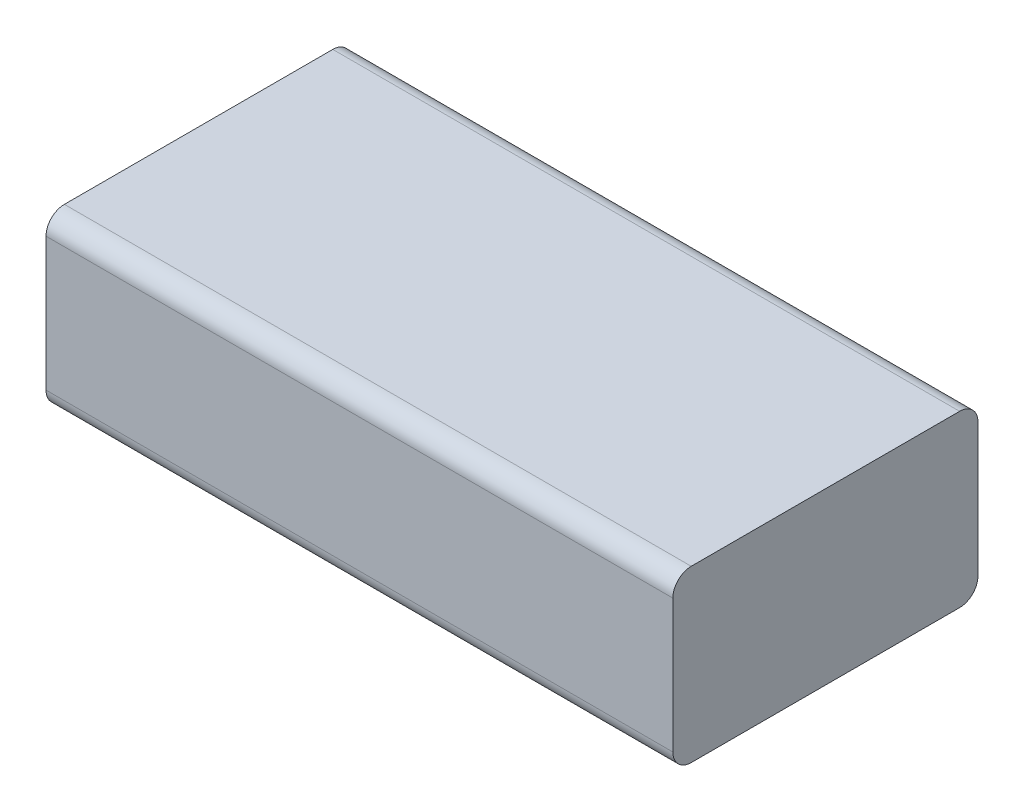
ISO-10303-21;
HEADER;
FILE_DESCRIPTION(('STEP AP214'),'2;1');
FILE_NAME('part.step','',(''),(''),'','','');
FILE_SCHEMA(('AUTOMOTIVE_DESIGN { 1 0 10303 214 1 1 1 1 }'));
ENDSEC;
DATA;
#1=APPLICATION_CONTEXT('core data for automotive mechanical design processes');
#2=APPLICATION_PROTOCOL_DEFINITION('international standard','automotive_design',2000,#1);
#3=PRODUCT_CONTEXT('',#1,'mechanical');
#4=PRODUCT('Part','Part','',(#3));
#5=PRODUCT_RELATED_PRODUCT_CATEGORY('part','',(#4));
#6=PRODUCT_DEFINITION_FORMATION('','',#4);
#7=PRODUCT_DEFINITION_CONTEXT('part definition',#1,'design');
#8=PRODUCT_DEFINITION('design','',#6,#7);
#9=PRODUCT_DEFINITION_SHAPE('','',#8);
#10=(LENGTH_UNIT() NAMED_UNIT(*) SI_UNIT(.MILLI.,.METRE.));
#11=(NAMED_UNIT(*) PLANE_ANGLE_UNIT() SI_UNIT($,.RADIAN.));
#12=(NAMED_UNIT(*) SI_UNIT($,.STERADIAN.) SOLID_ANGLE_UNIT());
#13=UNCERTAINTY_MEASURE_WITH_UNIT(LENGTH_MEASURE(1.E-05),#10,'distance_accuracy_value','');
#14=(GEOMETRIC_REPRESENTATION_CONTEXT(3) GLOBAL_UNCERTAINTY_ASSIGNED_CONTEXT((#13)) GLOBAL_UNIT_ASSIGNED_CONTEXT((#10,
#11,#12)) REPRESENTATION_CONTEXT('',''));
#15=CARTESIAN_POINT('',(0.,0.,0.));
#16=DIRECTION('',(0.,0.,1.));
#17=DIRECTION('',(1.,0.,0.));
#18=AXIS2_PLACEMENT_3D('',#15,#16,#17);
#19=CARTESIAN_POINT('',(34.1,18.5,16.6));
#20=DIRECTION('',(-1.,0.,0.));
#21=DIRECTION('',(0.,0.,1.));
#22=AXIS2_PLACEMENT_3D('',#19,#20,#21);
#23=PLANE('',#22);
#24=DIRECTION('',(0.,-1.,0.));
#25=VECTOR('',#24,1.);
#26=CARTESIAN_POINT('',(34.1,18.5,-16.6));
#27=LINE('',#26,#25);
#28=CARTESIAN_POINT('',(34.1,16.5,-16.6));
#29=VERTEX_POINT('',#28);
#30=CARTESIAN_POINT('',(34.1,2.,-16.6));
#31=VERTEX_POINT('',#30);
#32=EDGE_CURVE('E121',#29,#31,#27,.T.);
#33=ORIENTED_EDGE('',*,*,#32,.F.);
#34=CARTESIAN_POINT('',(34.1,16.5,-14.6));
#35=DIRECTION('',(-1.,0.,0.));
#36=DIRECTION('',(0.,0.,1.));
#37=AXIS2_PLACEMENT_3D('',#34,#35,#36);
#38=CIRCLE('',#37,2.);
#39=CARTESIAN_POINT('',(34.1,18.5,-14.6));
#40=VERTEX_POINT('',#39);
#41=EDGE_CURVE('E125',#29,#40,#38,.F.);
#42=ORIENTED_EDGE('',*,*,#41,.T.);
#43=DIRECTION('',(0.,0.,-1.));
#44=VECTOR('',#43,1.);
#45=CARTESIAN_POINT('',(34.1,18.5,16.6));
#46=LINE('',#45,#44);
#47=CARTESIAN_POINT('',(34.1,18.5,14.6));
#48=VERTEX_POINT('',#47);
#49=EDGE_CURVE('E116',#48,#40,#46,.T.);
#50=ORIENTED_EDGE('',*,*,#49,.F.);
#51=CARTESIAN_POINT('',(34.1,16.5,14.6));
#52=DIRECTION('',(-1.,0.,0.));
#53=DIRECTION('',(0.,0.,1.));
#54=AXIS2_PLACEMENT_3D('',#51,#52,#53);
#55=CIRCLE('',#54,2.);
#56=CARTESIAN_POINT('',(34.1,16.5,16.6));
#57=VERTEX_POINT('',#56);
#58=EDGE_CURVE('E62',#48,#57,#55,.F.);
#59=ORIENTED_EDGE('',*,*,#58,.T.);
#60=DIRECTION('',(0.,-1.,0.));
#61=VECTOR('',#60,1.);
#62=CARTESIAN_POINT('',(34.1,18.5,16.6));
#63=LINE('',#62,#61);
#64=CARTESIAN_POINT('',(34.1,2.,16.6));
#65=VERTEX_POINT('',#64);
#66=EDGE_CURVE('E128',#57,#65,#63,.T.);
#67=ORIENTED_EDGE('',*,*,#66,.T.);
#68=CARTESIAN_POINT('',(34.1,2.,14.6));
#69=DIRECTION('',(-1.,0.,0.));
#70=DIRECTION('',(0.,0.,1.));
#71=AXIS2_PLACEMENT_3D('',#68,#69,#70);
#72=CIRCLE('',#71,2.);
#73=CARTESIAN_POINT('',(34.1,0.,14.6));
#74=VERTEX_POINT('',#73);
#75=EDGE_CURVE('E55',#65,#74,#72,.F.);
#76=ORIENTED_EDGE('',*,*,#75,.T.);
#77=DIRECTION('',(0.,0.,-1.));
#78=VECTOR('',#77,1.);
#79=CARTESIAN_POINT('',(34.1,0.,16.6));
#80=LINE('',#79,#78);
#81=CARTESIAN_POINT('',(34.1,0.,-14.6));
#82=VERTEX_POINT('',#81);
#83=EDGE_CURVE('E131',#74,#82,#80,.T.);
#84=ORIENTED_EDGE('',*,*,#83,.T.);
#85=CARTESIAN_POINT('',(34.1,2.,-14.6));
#86=DIRECTION('',(-1.,0.,0.));
#87=DIRECTION('',(0.,0.,1.));
#88=AXIS2_PLACEMENT_3D('',#85,#86,#87);
#89=CIRCLE('',#88,2.);
#90=EDGE_CURVE('E159',#82,#31,#89,.F.);
#91=ORIENTED_EDGE('',*,*,#90,.T.);
#92=EDGE_LOOP('',(#33,#42,#50,#59,#67,#76,#84,#91));
#93=FACE_BOUND('',#92,.T.);
#94=ADVANCED_FACE('F40',(#93),#23,.F.);
#95=CARTESIAN_POINT('',(-34.1,18.5,-16.6));
#96=DIRECTION('',(0.,0.,1.));
#97=DIRECTION('',(1.,0.,0.));
#98=AXIS2_PLACEMENT_3D('',#95,#96,#97);
#99=PLANE('',#98);
#100=DIRECTION('',(0.,-1.,0.));
#101=VECTOR('',#100,1.);
#102=CARTESIAN_POINT('',(-34.1,18.5,-16.6));
#103=LINE('',#102,#101);
#104=CARTESIAN_POINT('',(-34.1,16.5,-16.6));
#105=VERTEX_POINT('',#104);
#106=CARTESIAN_POINT('',(-34.1,2.,-16.6));
#107=VERTEX_POINT('',#106);
#108=EDGE_CURVE('E140',#105,#107,#103,.T.);
#109=ORIENTED_EDGE('',*,*,#108,.F.);
#110=DIRECTION('',(-1.,0.,0.));
#111=VECTOR('',#110,1.);
#112=CARTESIAN_POINT('',(-34.1,16.5,-16.6));
#113=LINE('',#112,#111);
#114=EDGE_CURVE('E109',#105,#29,#113,.F.);
#115=ORIENTED_EDGE('',*,*,#114,.T.);
#116=ORIENTED_EDGE('',*,*,#32,.T.);
#117=DIRECTION('',(-1.,0.,0.));
#118=VECTOR('',#117,1.);
#119=CARTESIAN_POINT('',(-34.1,2.,-16.6));
#120=LINE('',#119,#118);
#121=EDGE_CURVE('E154',#31,#107,#120,.T.);
#122=ORIENTED_EDGE('',*,*,#121,.T.);
#123=EDGE_LOOP('',(#109,#115,#116,#122));
#124=FACE_BOUND('',#123,.T.);
#125=ADVANCED_FACE('F183',(#124),#99,.F.);
#126=CARTESIAN_POINT('',(-34.1,18.5,16.6));
#127=DIRECTION('',(1.,0.,0.));
#128=DIRECTION('',(0.,0.,-1.));
#129=AXIS2_PLACEMENT_3D('',#126,#127,#128);
#130=PLANE('',#129);
#131=DIRECTION('',(0.,0.,1.));
#132=VECTOR('',#131,1.);
#133=CARTESIAN_POINT('',(-34.1,18.5,16.6));
#134=LINE('',#133,#132);
#135=CARTESIAN_POINT('',(-34.1,18.5,-14.6));
#136=VERTEX_POINT('',#135);
#137=CARTESIAN_POINT('',(-34.1,18.5,14.6));
#138=VERTEX_POINT('',#137);
#139=EDGE_CURVE('E119',#136,#138,#134,.T.);
#140=ORIENTED_EDGE('',*,*,#139,.F.);
#141=CARTESIAN_POINT('',(-34.1,16.5,-14.6));
#142=DIRECTION('',(1.,0.,0.));
#143=DIRECTION('',(0.,0.,-1.));
#144=AXIS2_PLACEMENT_3D('',#141,#142,#143);
#145=CIRCLE('',#144,2.);
#146=EDGE_CURVE('E152',#136,#105,#145,.F.);
#147=ORIENTED_EDGE('',*,*,#146,.T.);
#148=ORIENTED_EDGE('',*,*,#108,.T.);
#149=CARTESIAN_POINT('',(-34.1,2.,-14.6));
#150=DIRECTION('',(1.,0.,0.));
#151=DIRECTION('',(0.,0.,-1.));
#152=AXIS2_PLACEMENT_3D('',#149,#150,#151);
#153=CIRCLE('',#152,2.);
#154=CARTESIAN_POINT('',(-34.1,0.,-14.6));
#155=VERTEX_POINT('',#154);
#156=EDGE_CURVE('E150',#107,#155,#153,.F.);
#157=ORIENTED_EDGE('',*,*,#156,.T.);
#158=DIRECTION('',(0.,0.,1.));
#159=VECTOR('',#158,1.);
#160=CARTESIAN_POINT('',(-34.1,0.,16.6));
#161=LINE('',#160,#159);
#162=CARTESIAN_POINT('',(-34.1,0.,14.6));
#163=VERTEX_POINT('',#162);
#164=EDGE_CURVE('E126',#155,#163,#161,.T.);
#165=ORIENTED_EDGE('',*,*,#164,.T.);
#166=CARTESIAN_POINT('',(-34.1,2.,14.6));
#167=DIRECTION('',(1.,0.,0.));
#168=DIRECTION('',(0.,0.,-1.));
#169=AXIS2_PLACEMENT_3D('',#166,#167,#168);
#170=CIRCLE('',#169,2.);
#171=CARTESIAN_POINT('',(-34.1,2.,16.6));
#172=VERTEX_POINT('',#171);
#173=EDGE_CURVE('E148',#163,#172,#170,.F.);
#174=ORIENTED_EDGE('',*,*,#173,.T.);
#175=DIRECTION('',(0.,-1.,0.));
#176=VECTOR('',#175,1.);
#177=CARTESIAN_POINT('',(-34.1,18.5,16.6));
#178=LINE('',#177,#176);
#179=CARTESIAN_POINT('',(-34.1,16.5,16.6));
#180=VERTEX_POINT('',#179);
#181=EDGE_CURVE('E137',#180,#172,#178,.T.);
#182=ORIENTED_EDGE('',*,*,#181,.F.);
#183=CARTESIAN_POINT('',(-34.1,16.5,14.6));
#184=DIRECTION('',(1.,0.,0.));
#185=DIRECTION('',(0.,0.,-1.));
#186=AXIS2_PLACEMENT_3D('',#183,#184,#185);
#187=CIRCLE('',#186,2.);
#188=EDGE_CURVE('E146',#180,#138,#187,.F.);
#189=ORIENTED_EDGE('',*,*,#188,.T.);
#190=EDGE_LOOP('',(#140,#147,#148,#157,#165,#174,#182,#189));
#191=FACE_BOUND('',#190,.T.);
#192=ADVANCED_FACE('F169',(#191),#130,.F.);
#193=CARTESIAN_POINT('',(-34.1,18.5,16.6));
#194=DIRECTION('',(0.,0.,-1.));
#195=DIRECTION('',(-1.,0.,0.));
#196=AXIS2_PLACEMENT_3D('',#193,#194,#195);
#197=PLANE('',#196);
#198=ORIENTED_EDGE('',*,*,#181,.T.);
#199=DIRECTION('',(1.,0.,0.));
#200=VECTOR('',#199,1.);
#201=CARTESIAN_POINT('',(34.1,2.,16.6));
#202=LINE('',#201,#200);
#203=EDGE_CURVE('E11',#172,#65,#202,.T.);
#204=ORIENTED_EDGE('',*,*,#203,.T.);
#205=ORIENTED_EDGE('',*,*,#66,.F.);
#206=DIRECTION('',(1.,0.,0.));
#207=VECTOR('',#206,1.);
#208=CARTESIAN_POINT('',(-34.1,16.5,16.6));
#209=LINE('',#208,#207);
#210=EDGE_CURVE('E48',#57,#180,#209,.F.);
#211=ORIENTED_EDGE('',*,*,#210,.T.);
#212=EDGE_LOOP('',(#198,#204,#205,#211));
#213=FACE_BOUND('',#212,.T.);
#214=ADVANCED_FACE('F167',(#213),#197,.F.);
#215=CARTESIAN_POINT('',(0.,18.5,0.));
#216=DIRECTION('',(0.,-1.,0.));
#217=DIRECTION('',(0.,0.,-1.));
#218=AXIS2_PLACEMENT_3D('',#215,#216,#217);
#219=PLANE('',#218);
#220=ORIENTED_EDGE('',*,*,#49,.T.);
#221=DIRECTION('',(-1.,0.,0.));
#222=VECTOR('',#221,1.);
#223=CARTESIAN_POINT('',(0.,18.5,-14.6));
#224=LINE('',#223,#222);
#225=EDGE_CURVE('E120',#40,#136,#224,.T.);
#226=ORIENTED_EDGE('',*,*,#225,.T.);
#227=ORIENTED_EDGE('',*,*,#139,.T.);
#228=DIRECTION('',(1.,0.,0.));
#229=VECTOR('',#228,1.);
#230=CARTESIAN_POINT('',(0.,18.5,14.6));
#231=LINE('',#230,#229);
#232=EDGE_CURVE('E108',#138,#48,#231,.T.);
#233=ORIENTED_EDGE('',*,*,#232,.T.);
#234=EDGE_LOOP('',(#220,#226,#227,#233));
#235=FACE_BOUND('',#234,.T.);
#236=ADVANCED_FACE('F114',(#235),#219,.F.);
#237=CARTESIAN_POINT('',(0.,0.,0.));
#238=DIRECTION('',(0.,-1.,0.));
#239=DIRECTION('',(0.,0.,-1.));
#240=AXIS2_PLACEMENT_3D('',#237,#238,#239);
#241=PLANE('',#240);
#242=ORIENTED_EDGE('',*,*,#164,.F.);
#243=DIRECTION('',(-1.,0.,0.));
#244=VECTOR('',#243,1.);
#245=CARTESIAN_POINT('',(34.1,0.,-14.6));
#246=LINE('',#245,#244);
#247=EDGE_CURVE('E164',#155,#82,#246,.F.);
#248=ORIENTED_EDGE('',*,*,#247,.T.);
#249=ORIENTED_EDGE('',*,*,#83,.F.);
#250=DIRECTION('',(1.,0.,0.));
#251=VECTOR('',#250,1.);
#252=CARTESIAN_POINT('',(-34.1,0.,14.6));
#253=LINE('',#252,#251);
#254=EDGE_CURVE('E162',#74,#163,#253,.F.);
#255=ORIENTED_EDGE('',*,*,#254,.T.);
#256=EDGE_LOOP('',(#242,#248,#249,#255));
#257=FACE_BOUND('',#256,.T.);
#258=ADVANCED_FACE('F176',(#257),#241,.T.);
#259=CARTESIAN_POINT('',(0.,16.5,-14.6));
#260=DIRECTION('',(-1.,0.,0.));
#261=DIRECTION('',(0.,0.,1.));
#262=AXIS2_PLACEMENT_3D('',#259,#260,#261);
#263=CYLINDRICAL_SURFACE('',#262,2.);
#264=ORIENTED_EDGE('',*,*,#41,.F.);
#265=ORIENTED_EDGE('',*,*,#114,.F.);
#266=ORIENTED_EDGE('',*,*,#146,.F.);
#267=ORIENTED_EDGE('',*,*,#225,.F.);
#268=EDGE_LOOP('',(#264,#265,#266,#267));
#269=FACE_BOUND('',#268,.T.);
#270=ADVANCED_FACE('F186',(#269),#263,.T.);
#271=CARTESIAN_POINT('',(-34.1,2.,-14.6));
#272=DIRECTION('',(1.,0.,0.));
#273=DIRECTION('',(0.,0.,-1.));
#274=AXIS2_PLACEMENT_3D('',#271,#272,#273);
#275=CYLINDRICAL_SURFACE('',#274,2.);
#276=ORIENTED_EDGE('',*,*,#90,.F.);
#277=ORIENTED_EDGE('',*,*,#247,.F.);
#278=ORIENTED_EDGE('',*,*,#156,.F.);
#279=ORIENTED_EDGE('',*,*,#121,.F.);
#280=EDGE_LOOP('',(#276,#277,#278,#279));
#281=FACE_BOUND('',#280,.T.);
#282=ADVANCED_FACE('F179',(#281),#275,.T.);
#283=CARTESIAN_POINT('',(-34.1,2.,14.6));
#284=DIRECTION('',(-1.,0.,0.));
#285=DIRECTION('',(0.,0.,1.));
#286=AXIS2_PLACEMENT_3D('',#283,#284,#285);
#287=CYLINDRICAL_SURFACE('',#286,2.);
#288=ORIENTED_EDGE('',*,*,#173,.F.);
#289=ORIENTED_EDGE('',*,*,#254,.F.);
#290=ORIENTED_EDGE('',*,*,#75,.F.);
#291=ORIENTED_EDGE('',*,*,#203,.F.);
#292=EDGE_LOOP('',(#288,#289,#290,#291));
#293=FACE_BOUND('',#292,.T.);
#294=ADVANCED_FACE('F172',(#293),#287,.T.);
#295=CARTESIAN_POINT('',(0.,16.5,14.6));
#296=DIRECTION('',(1.,0.,0.));
#297=DIRECTION('',(0.,0.,-1.));
#298=AXIS2_PLACEMENT_3D('',#295,#296,#297);
#299=CYLINDRICAL_SURFACE('',#298,2.);
#300=ORIENTED_EDGE('',*,*,#188,.F.);
#301=ORIENTED_EDGE('',*,*,#210,.F.);
#302=ORIENTED_EDGE('',*,*,#58,.F.);
#303=ORIENTED_EDGE('',*,*,#232,.F.);
#304=EDGE_LOOP('',(#300,#301,#302,#303));
#305=FACE_BOUND('',#304,.T.);
#306=ADVANCED_FACE('F42',(#305),#299,.T.);
#307=CLOSED_SHELL('',(#94,#125,#192,#214,#236,#258,#270,#282,#294,#306));
#308=MANIFOLD_SOLID_BREP('B2',#307);
#309=ADVANCED_BREP_SHAPE_REPRESENTATION('',(#18,#308),#14);
#310=SHAPE_DEFINITION_REPRESENTATION(#9,#309);
ENDSEC;
END-ISO-10303-21;
